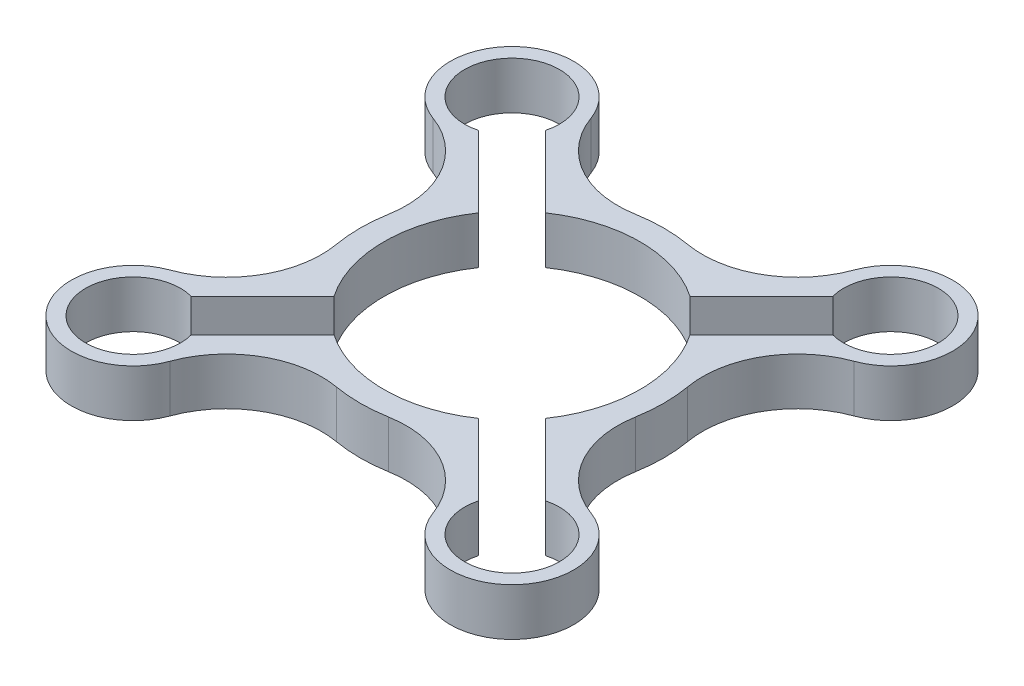
ISO-10303-21;
HEADER;
FILE_DESCRIPTION(('STEP AP214'),'2;1');
FILE_NAME('part.step','',(''),(''),'','','');
FILE_SCHEMA(('AUTOMOTIVE_DESIGN { 1 0 10303 214 1 1 1 1 }'));
ENDSEC;
DATA;
#1=APPLICATION_CONTEXT('core data for automotive mechanical design processes');
#2=APPLICATION_PROTOCOL_DEFINITION('international standard','automotive_design',2000,#1);
#3=PRODUCT_CONTEXT('',#1,'mechanical');
#4=PRODUCT('Part','Part','',(#3));
#5=PRODUCT_RELATED_PRODUCT_CATEGORY('part','',(#4));
#6=PRODUCT_DEFINITION_FORMATION('','',#4);
#7=PRODUCT_DEFINITION_CONTEXT('part definition',#1,'design');
#8=PRODUCT_DEFINITION('design','',#6,#7);
#9=PRODUCT_DEFINITION_SHAPE('','',#8);
#10=(LENGTH_UNIT() NAMED_UNIT(*) SI_UNIT(.MILLI.,.METRE.));
#11=(NAMED_UNIT(*) PLANE_ANGLE_UNIT() SI_UNIT($,.RADIAN.));
#12=(NAMED_UNIT(*) SI_UNIT($,.STERADIAN.) SOLID_ANGLE_UNIT());
#13=UNCERTAINTY_MEASURE_WITH_UNIT(LENGTH_MEASURE(1.E-05),#10,'distance_accuracy_value','');
#14=(GEOMETRIC_REPRESENTATION_CONTEXT(3) GLOBAL_UNCERTAINTY_ASSIGNED_CONTEXT((#13)) GLOBAL_UNIT_ASSIGNED_CONTEXT((#10,
#11,#12)) REPRESENTATION_CONTEXT('',''));
#15=CARTESIAN_POINT('',(0.,0.,0.));
#16=DIRECTION('',(0.,0.,1.));
#17=DIRECTION('',(1.,0.,0.));
#18=AXIS2_PLACEMENT_3D('',#15,#16,#17);
#19=CARTESIAN_POINT('',(-4.46865767521835,10.,-25.6131040403484));
#20=DIRECTION('',(0.,1.,0.));
#21=DIRECTION('',(0.,0.,1.));
#22=AXIS2_PLACEMENT_3D('',#19,#20,#21);
#23=PLANE('',#22);
#24=CARTESIAN_POINT('',(-8.93731535043669,10.,-51.2262080806968));
#25=DIRECTION('',(0.,-1.,0.));
#26=DIRECTION('',(0.,0.,1.));
#27=AXIS2_PLACEMENT_3D('',#24,#25,#26);
#28=CIRCLE('',#27,20.);
#29=CARTESIAN_POINT('',(-5.4998863694995,10.,-31.5238203573519));
#30=VERTEX_POINT('',#29);
#31=CARTESIAN_POINT('',(-27.7338109786812,10.,-44.3930717512077));
#32=VERTEX_POINT('',#31);
#33=EDGE_CURVE('E367',#30,#32,#28,.T.);
#34=ORIENTED_EDGE('',*,*,#33,.T.);
#35=CARTESIAN_POINT('',(-39.9515331370402,10.,-39.9515331370397));
#36=DIRECTION('',(0.,1.,0.));
#37=DIRECTION('',(0.,0.,1.));
#38=AXIS2_PLACEMENT_3D('',#35,#36,#37);
#39=CIRCLE('',#38,13.);
#40=CARTESIAN_POINT('',(-44.393071751208,10.,-27.7338109786807));
#41=VERTEX_POINT('',#40);
#42=EDGE_CURVE('E370',#32,#41,#39,.T.);
#43=ORIENTED_EDGE('',*,*,#42,.T.);
#44=CARTESIAN_POINT('',(-51.2262080806969,10.,-8.93731535043613));
#45=DIRECTION('',(0.,-1.,0.));
#46=DIRECTION('',(0.,0.,-1.));
#47=AXIS2_PLACEMENT_3D('',#44,#45,#46);
#48=CIRCLE('',#47,20.);
#49=CARTESIAN_POINT('',(-31.523820357352,10.,-5.49988636949915));
#50=VERTEX_POINT('',#49);
#51=EDGE_CURVE('E373',#41,#50,#48,.T.);
#52=ORIENTED_EDGE('',*,*,#51,.T.);
#53=CARTESIAN_POINT('',(0.,10.,0.));
#54=DIRECTION('',(0.,1.,0.));
#55=DIRECTION('',(0.,0.,1.));
#56=AXIS2_PLACEMENT_3D('',#53,#54,#55);
#57=CIRCLE('',#56,32.);
#58=CARTESIAN_POINT('',(-31.523820357352,10.,5.49988636949914));
#59=VERTEX_POINT('',#58);
#60=EDGE_CURVE('E375',#50,#59,#57,.T.);
#61=ORIENTED_EDGE('',*,*,#60,.T.);
#62=CARTESIAN_POINT('',(-51.2262080806969,10.,8.93731535043614));
#63=DIRECTION('',(0.,-1.,0.));
#64=DIRECTION('',(0.,0.,1.));
#65=AXIS2_PLACEMENT_3D('',#62,#63,#64);
#66=CIRCLE('',#65,20.);
#67=CARTESIAN_POINT('',(-44.393071751208,10.,27.7338109786807));
#68=VERTEX_POINT('',#67);
#69=EDGE_CURVE('E377',#59,#68,#66,.T.);
#70=ORIENTED_EDGE('',*,*,#69,.T.);
#71=CARTESIAN_POINT('',(-39.9515331370401,10.,39.9515331370397));
#72=DIRECTION('',(0.,1.,0.));
#73=DIRECTION('',(0.,0.,-1.));
#74=AXIS2_PLACEMENT_3D('',#71,#72,#73);
#75=CIRCLE('',#74,13.);
#76=CARTESIAN_POINT('',(-27.7338109786812,10.,44.3930717512077));
#77=VERTEX_POINT('',#76);
#78=EDGE_CURVE('E379',#68,#77,#75,.T.);
#79=ORIENTED_EDGE('',*,*,#78,.T.);
#80=CARTESIAN_POINT('',(-8.93731535043668,10.,51.2262080806968));
#81=DIRECTION('',(0.,-1.,0.));
#82=DIRECTION('',(0.,0.,-1.));
#83=AXIS2_PLACEMENT_3D('',#80,#81,#82);
#84=CIRCLE('',#83,20.);
#85=CARTESIAN_POINT('',(-5.4998863694995,10.,31.5238203573519));
#86=VERTEX_POINT('',#85);
#87=EDGE_CURVE('E381',#77,#86,#84,.T.);
#88=ORIENTED_EDGE('',*,*,#87,.T.);
#89=CARTESIAN_POINT('',(0.,10.,0.));
#90=DIRECTION('',(0.,1.,0.));
#91=DIRECTION('',(0.,0.,1.));
#92=AXIS2_PLACEMENT_3D('',#89,#90,#91);
#93=CIRCLE('',#92,32.);
#94=CARTESIAN_POINT('',(5.49988636949951,10.,31.5238203573519));
#95=VERTEX_POINT('',#94);
#96=EDGE_CURVE('E383',#86,#95,#93,.T.);
#97=ORIENTED_EDGE('',*,*,#96,.T.);
#98=CARTESIAN_POINT('',(8.93731535043671,10.,51.2262080806968));
#99=DIRECTION('',(0.,-1.,0.));
#100=DIRECTION('',(0.,0.,1.));
#101=AXIS2_PLACEMENT_3D('',#98,#99,#100);
#102=CIRCLE('',#101,20.);
#103=CARTESIAN_POINT('',(27.7338109786812,10.,44.3930717512077));
#104=VERTEX_POINT('',#103);
#105=EDGE_CURVE('E385',#95,#104,#102,.T.);
#106=ORIENTED_EDGE('',*,*,#105,.T.);
#107=CARTESIAN_POINT('',(39.9515331370402,10.,39.9515331370397));
#108=DIRECTION('',(0.,1.,0.));
#109=DIRECTION('',(0.,0.,1.));
#110=AXIS2_PLACEMENT_3D('',#107,#108,#109);
#111=CIRCLE('',#110,13.);
#112=CARTESIAN_POINT('',(44.393071751208,10.,27.7338109786807));
#113=VERTEX_POINT('',#112);
#114=EDGE_CURVE('E387',#104,#113,#111,.T.);
#115=ORIENTED_EDGE('',*,*,#114,.T.);
#116=CARTESIAN_POINT('',(51.2262080806969,10.,8.93731535043611));
#117=DIRECTION('',(0.,-1.,0.));
#118=DIRECTION('',(0.,0.,-1.));
#119=AXIS2_PLACEMENT_3D('',#116,#117,#118);
#120=CIRCLE('',#119,20.);
#121=CARTESIAN_POINT('',(31.523820357352,10.,5.49988636949915));
#122=VERTEX_POINT('',#121);
#123=EDGE_CURVE('E389',#113,#122,#120,.T.);
#124=ORIENTED_EDGE('',*,*,#123,.T.);
#125=CARTESIAN_POINT('',(0.,10.,0.));
#126=DIRECTION('',(0.,1.,0.));
#127=DIRECTION('',(0.,0.,1.));
#128=AXIS2_PLACEMENT_3D('',#125,#126,#127);
#129=CIRCLE('',#128,32.);
#130=CARTESIAN_POINT('',(31.523820357352,10.,-5.49988636949915));
#131=VERTEX_POINT('',#130);
#132=EDGE_CURVE('E391',#122,#131,#129,.T.);
#133=ORIENTED_EDGE('',*,*,#132,.T.);
#134=CARTESIAN_POINT('',(51.2262080806969,10.,-8.93731535043613));
#135=DIRECTION('',(0.,-1.,0.));
#136=DIRECTION('',(0.,0.,1.));
#137=AXIS2_PLACEMENT_3D('',#134,#135,#136);
#138=CIRCLE('',#137,20.);
#139=CARTESIAN_POINT('',(44.393071751208,10.,-27.7338109786807));
#140=VERTEX_POINT('',#139);
#141=EDGE_CURVE('E393',#131,#140,#138,.T.);
#142=ORIENTED_EDGE('',*,*,#141,.T.);
#143=CARTESIAN_POINT('',(39.9515331370402,10.,-39.9515331370397));
#144=DIRECTION('',(0.,1.,0.));
#145=DIRECTION('',(0.,0.,-1.));
#146=AXIS2_PLACEMENT_3D('',#143,#144,#145);
#147=CIRCLE('',#146,13.);
#148=CARTESIAN_POINT('',(27.7338109786812,10.,-44.3930717512077));
#149=VERTEX_POINT('',#148);
#150=EDGE_CURVE('E395',#140,#149,#147,.T.);
#151=ORIENTED_EDGE('',*,*,#150,.T.);
#152=CARTESIAN_POINT('',(8.93731535043669,10.,-51.2262080806968));
#153=DIRECTION('',(0.,-1.,0.));
#154=DIRECTION('',(0.,0.,-1.));
#155=AXIS2_PLACEMENT_3D('',#152,#153,#154);
#156=CIRCLE('',#155,20.);
#157=CARTESIAN_POINT('',(5.49988636949951,10.,-31.5238203573519));
#158=VERTEX_POINT('',#157);
#159=EDGE_CURVE('E397',#149,#158,#156,.T.);
#160=ORIENTED_EDGE('',*,*,#159,.T.);
#161=CARTESIAN_POINT('',(0.,10.,0.));
#162=DIRECTION('',(0.,1.,0.));
#163=DIRECTION('',(0.,0.,1.));
#164=AXIS2_PLACEMENT_3D('',#161,#162,#163);
#165=CIRCLE('',#164,32.);
#166=EDGE_CURVE('E399',#158,#30,#165,.T.);
#167=ORIENTED_EDGE('',*,*,#166,.T.);
#168=EDGE_LOOP('',(#34,#43,#52,#61,#70,#79,#88,#97,#106,#115,#124,#133,#142,#151,#160,#167));
#169=FACE_BOUND('',#168,.T.);
#170=DIRECTION('',(0.707106781186552,0.,0.707106781186543));
#171=VECTOR('',#170,1.);
#172=CARTESIAN_POINT('',(-37.3633426860149,10.,-30.2922748741491));
#173=LINE('',#172,#171);
#174=CARTESIAN_POINT('',(-37.3633426860149,10.,-30.2922748741491));
#175=VERTEX_POINT('',#174);
#176=CARTESIAN_POINT('',(-22.2971969452265,10.,-15.2261291333609));
#177=VERTEX_POINT('',#176);
#178=EDGE_CURVE('E254',#175,#177,#173,.T.);
#179=ORIENTED_EDGE('',*,*,#178,.F.);
#180=CARTESIAN_POINT('',(-39.9515331370402,10.,-39.9515331370397));
#181=DIRECTION('',(0.,1.,0.));
#182=DIRECTION('',(0.,0.,1.));
#183=AXIS2_PLACEMENT_3D('',#180,#181,#182);
#184=CIRCLE('',#183,10.);
#185=CARTESIAN_POINT('',(-30.2922748741495,10.,-37.3633426860146));
#186=VERTEX_POINT('',#185);
#187=EDGE_CURVE('E246',#186,#175,#184,.T.);
#188=ORIENTED_EDGE('',*,*,#187,.F.);
#189=DIRECTION('',(-0.707106781186551,0.,-0.707106781186544));
#190=VECTOR('',#189,1.);
#191=CARTESIAN_POINT('',(-30.2922748741495,10.,-37.3633426860146));
#192=LINE('',#191,#190);
#193=CARTESIAN_POINT('',(-15.2261291333611,10.,-22.2971969452264));
#194=VERTEX_POINT('',#193);
#195=EDGE_CURVE('E295',#194,#186,#192,.T.);
#196=ORIENTED_EDGE('',*,*,#195,.F.);
#197=CARTESIAN_POINT('',(0.,10.,0.));
#198=DIRECTION('',(0.,1.,0.));
#199=DIRECTION('',(0.,0.,1.));
#200=AXIS2_PLACEMENT_3D('',#197,#198,#199);
#201=CIRCLE('',#200,27.);
#202=CARTESIAN_POINT('',(15.2261291333611,10.,-22.2971969452264));
#203=VERTEX_POINT('',#202);
#204=EDGE_CURVE('E293',#203,#194,#201,.T.);
#205=ORIENTED_EDGE('',*,*,#204,.F.);
#206=DIRECTION('',(-0.707106781186551,0.,0.707106781186544));
#207=VECTOR('',#206,1.);
#208=CARTESIAN_POINT('',(30.2922748741495,10.,-37.3633426860146));
#209=LINE('',#208,#207);
#210=CARTESIAN_POINT('',(30.2922748741495,10.,-37.3633426860146));
#211=VERTEX_POINT('',#210);
#212=EDGE_CURVE('E291',#211,#203,#209,.T.);
#213=ORIENTED_EDGE('',*,*,#212,.F.);
#214=CARTESIAN_POINT('',(39.9515331370402,10.,-39.9515331370397));
#215=DIRECTION('',(0.,1.,0.));
#216=DIRECTION('',(0.,0.,-1.));
#217=AXIS2_PLACEMENT_3D('',#214,#215,#216);
#218=CIRCLE('',#217,10.);
#219=CARTESIAN_POINT('',(37.3633426860149,10.,-30.292274874149));
#220=VERTEX_POINT('',#219);
#221=EDGE_CURVE('E289',#220,#211,#218,.T.);
#222=ORIENTED_EDGE('',*,*,#221,.F.);
#223=DIRECTION('',(0.707106781186551,0.,-0.707106781186544));
#224=VECTOR('',#223,1.);
#225=CARTESIAN_POINT('',(37.3633426860149,10.,-30.292274874149));
#226=LINE('',#225,#224);
#227=CARTESIAN_POINT('',(22.2971969452265,10.,-15.2261291333608));
#228=VERTEX_POINT('',#227);
#229=EDGE_CURVE('E287',#228,#220,#226,.T.);
#230=ORIENTED_EDGE('',*,*,#229,.F.);
#231=CARTESIAN_POINT('',(0.,10.,0.));
#232=DIRECTION('',(0.,1.,0.));
#233=DIRECTION('',(0.,0.,1.));
#234=AXIS2_PLACEMENT_3D('',#231,#232,#233);
#235=CIRCLE('',#234,27.);
#236=CARTESIAN_POINT('',(22.2971969452266,10.,15.2261291333608));
#237=VERTEX_POINT('',#236);
#238=EDGE_CURVE('E285',#237,#228,#235,.T.);
#239=ORIENTED_EDGE('',*,*,#238,.F.);
#240=DIRECTION('',(-0.707106781186551,0.,-0.707106781186544));
#241=VECTOR('',#240,1.);
#242=CARTESIAN_POINT('',(37.3633426860149,10.,30.292274874149));
#243=LINE('',#242,#241);
#244=CARTESIAN_POINT('',(37.3633426860149,10.,30.292274874149));
#245=VERTEX_POINT('',#244);
#246=EDGE_CURVE('E283',#245,#237,#243,.T.);
#247=ORIENTED_EDGE('',*,*,#246,.F.);
#248=CARTESIAN_POINT('',(39.9515331370402,10.,39.9515331370397));
#249=DIRECTION('',(0.,1.,0.));
#250=DIRECTION('',(0.,0.,1.));
#251=AXIS2_PLACEMENT_3D('',#248,#249,#250);
#252=CIRCLE('',#251,10.);
#253=CARTESIAN_POINT('',(30.2922748741495,10.,37.3633426860145));
#254=VERTEX_POINT('',#253);
#255=EDGE_CURVE('E281',#254,#245,#252,.T.);
#256=ORIENTED_EDGE('',*,*,#255,.F.);
#257=DIRECTION('',(0.707106781186551,0.,0.707106781186543));
#258=VECTOR('',#257,1.);
#259=CARTESIAN_POINT('',(30.2922748741495,10.,37.3633426860145));
#260=LINE('',#259,#258);
#261=CARTESIAN_POINT('',(15.2261291333611,10.,22.2971969452264));
#262=VERTEX_POINT('',#261);
#263=EDGE_CURVE('E279',#262,#254,#260,.T.);
#264=ORIENTED_EDGE('',*,*,#263,.F.);
#265=CARTESIAN_POINT('',(0.,10.,0.));
#266=DIRECTION('',(0.,1.,0.));
#267=DIRECTION('',(0.,0.,1.));
#268=AXIS2_PLACEMENT_3D('',#265,#266,#267);
#269=CIRCLE('',#268,27.);
#270=CARTESIAN_POINT('',(-15.2261291333611,10.,22.2971969452264));
#271=VERTEX_POINT('',#270);
#272=EDGE_CURVE('E277',#271,#262,#269,.T.);
#273=ORIENTED_EDGE('',*,*,#272,.F.);
#274=DIRECTION('',(0.707106781186551,0.,-0.707106781186544));
#275=VECTOR('',#274,1.);
#276=CARTESIAN_POINT('',(-30.2922748741495,10.,37.3633426860146));
#277=LINE('',#276,#275);
#278=CARTESIAN_POINT('',(-30.2922748741494,10.,37.3633426860146));
#279=VERTEX_POINT('',#278);
#280=EDGE_CURVE('E275',#279,#271,#277,.T.);
#281=ORIENTED_EDGE('',*,*,#280,.F.);
#282=CARTESIAN_POINT('',(-39.9515331370401,10.,39.9515331370397));
#283=DIRECTION('',(0.,1.,0.));
#284=DIRECTION('',(0.,0.,-1.));
#285=AXIS2_PLACEMENT_3D('',#282,#283,#284);
#286=CIRCLE('',#285,10.);
#287=CARTESIAN_POINT('',(-37.3633426860149,10.,30.2922748741491));
#288=VERTEX_POINT('',#287);
#289=EDGE_CURVE('E273',#288,#279,#286,.T.);
#290=ORIENTED_EDGE('',*,*,#289,.F.);
#291=DIRECTION('',(-0.707106781186552,0.,0.707106781186544));
#292=VECTOR('',#291,1.);
#293=CARTESIAN_POINT('',(-37.3633426860149,10.,30.2922748741491));
#294=LINE('',#293,#292);
#295=CARTESIAN_POINT('',(-22.2971969452265,10.,15.2261291333609));
#296=VERTEX_POINT('',#295);
#297=EDGE_CURVE('E269',#296,#288,#294,.T.);
#298=ORIENTED_EDGE('',*,*,#297,.F.);
#299=CARTESIAN_POINT('',(0.,10.,0.));
#300=DIRECTION('',(0.,1.,0.));
#301=DIRECTION('',(0.,0.,1.));
#302=AXIS2_PLACEMENT_3D('',#299,#300,#301);
#303=CIRCLE('',#302,27.);
#304=EDGE_CURVE('E267',#177,#296,#303,.T.);
#305=ORIENTED_EDGE('',*,*,#304,.F.);
#306=EDGE_LOOP('',(#179,#188,#196,#205,#213,#222,#230,#239,#247,#256,#264,#273,#281,#290,#298,#305));
#307=FACE_BOUND('',#306,.T.);
#308=ADVANCED_FACE('F37',(#169,#307),#23,.T.);
#309=CARTESIAN_POINT('',(-4.46865767521835,0.,-25.6131040403484));
#310=DIRECTION('',(0.,1.,0.));
#311=DIRECTION('',(0.,0.,1.));
#312=AXIS2_PLACEMENT_3D('',#309,#310,#311);
#313=PLANE('',#312);
#314=CARTESIAN_POINT('',(-8.93731535043669,0.,-51.2262080806968));
#315=DIRECTION('',(0.,-1.,0.));
#316=DIRECTION('',(0.,0.,1.));
#317=AXIS2_PLACEMENT_3D('',#314,#315,#316);
#318=CIRCLE('',#317,20.);
#319=CARTESIAN_POINT('',(-5.4998863694995,0.,-31.5238203573519));
#320=VERTEX_POINT('',#319);
#321=CARTESIAN_POINT('',(-27.7338109786812,0.,-44.3930717512077));
#322=VERTEX_POINT('',#321);
#323=EDGE_CURVE('E262',#320,#322,#318,.T.);
#324=ORIENTED_EDGE('',*,*,#323,.F.);
#325=CARTESIAN_POINT('',(0.,0.,0.));
#326=DIRECTION('',(0.,1.,0.));
#327=DIRECTION('',(0.,0.,1.));
#328=AXIS2_PLACEMENT_3D('',#325,#326,#327);
#329=CIRCLE('',#328,32.);
#330=CARTESIAN_POINT('',(5.49988636949951,0.,-31.5238203573519));
#331=VERTEX_POINT('',#330);
#332=EDGE_CURVE('E371',#331,#320,#329,.T.);
#333=ORIENTED_EDGE('',*,*,#332,.F.);
#334=CARTESIAN_POINT('',(8.93731535043669,0.,-51.2262080806968));
#335=DIRECTION('',(0.,-1.,0.));
#336=DIRECTION('',(0.,0.,-1.));
#337=AXIS2_PLACEMENT_3D('',#334,#335,#336);
#338=CIRCLE('',#337,20.);
#339=CARTESIAN_POINT('',(27.7338109786812,0.,-44.3930717512077));
#340=VERTEX_POINT('',#339);
#341=EDGE_CURVE('E430',#340,#331,#338,.T.);
#342=ORIENTED_EDGE('',*,*,#341,.F.);
#343=CARTESIAN_POINT('',(39.9515331370402,0.,-39.9515331370397));
#344=DIRECTION('',(0.,1.,0.));
#345=DIRECTION('',(0.,0.,-1.));
#346=AXIS2_PLACEMENT_3D('',#343,#344,#345);
#347=CIRCLE('',#346,13.);
#348=CARTESIAN_POINT('',(44.393071751208,0.,-27.7338109786807));
#349=VERTEX_POINT('',#348);
#350=EDGE_CURVE('E428',#349,#340,#347,.T.);
#351=ORIENTED_EDGE('',*,*,#350,.F.);
#352=CARTESIAN_POINT('',(51.2262080806969,0.,-8.93731535043613));
#353=DIRECTION('',(0.,-1.,0.));
#354=DIRECTION('',(0.,0.,1.));
#355=AXIS2_PLACEMENT_3D('',#352,#353,#354);
#356=CIRCLE('',#355,20.);
#357=CARTESIAN_POINT('',(31.523820357352,0.,-5.49988636949915));
#358=VERTEX_POINT('',#357);
#359=EDGE_CURVE('E426',#358,#349,#356,.T.);
#360=ORIENTED_EDGE('',*,*,#359,.F.);
#361=CARTESIAN_POINT('',(0.,0.,0.));
#362=DIRECTION('',(0.,1.,0.));
#363=DIRECTION('',(0.,0.,1.));
#364=AXIS2_PLACEMENT_3D('',#361,#362,#363);
#365=CIRCLE('',#364,32.);
#366=CARTESIAN_POINT('',(31.523820357352,0.,5.49988636949915));
#367=VERTEX_POINT('',#366);
#368=EDGE_CURVE('E424',#367,#358,#365,.T.);
#369=ORIENTED_EDGE('',*,*,#368,.F.);
#370=CARTESIAN_POINT('',(51.2262080806969,0.,8.93731535043611));
#371=DIRECTION('',(0.,-1.,0.));
#372=DIRECTION('',(0.,0.,-1.));
#373=AXIS2_PLACEMENT_3D('',#370,#371,#372);
#374=CIRCLE('',#373,20.);
#375=CARTESIAN_POINT('',(44.393071751208,0.,27.7338109786807));
#376=VERTEX_POINT('',#375);
#377=EDGE_CURVE('E422',#376,#367,#374,.T.);
#378=ORIENTED_EDGE('',*,*,#377,.F.);
#379=CARTESIAN_POINT('',(39.9515331370402,0.,39.9515331370397));
#380=DIRECTION('',(0.,1.,0.));
#381=DIRECTION('',(0.,0.,1.));
#382=AXIS2_PLACEMENT_3D('',#379,#380,#381);
#383=CIRCLE('',#382,13.);
#384=CARTESIAN_POINT('',(27.7338109786812,0.,44.3930717512077));
#385=VERTEX_POINT('',#384);
#386=EDGE_CURVE('E420',#385,#376,#383,.T.);
#387=ORIENTED_EDGE('',*,*,#386,.F.);
#388=CARTESIAN_POINT('',(8.93731535043671,0.,51.2262080806968));
#389=DIRECTION('',(0.,-1.,0.));
#390=DIRECTION('',(0.,0.,1.));
#391=AXIS2_PLACEMENT_3D('',#388,#389,#390);
#392=CIRCLE('',#391,20.);
#393=CARTESIAN_POINT('',(5.49988636949951,0.,31.5238203573519));
#394=VERTEX_POINT('',#393);
#395=EDGE_CURVE('E418',#394,#385,#392,.T.);
#396=ORIENTED_EDGE('',*,*,#395,.F.);
#397=CARTESIAN_POINT('',(0.,0.,0.));
#398=DIRECTION('',(0.,1.,0.));
#399=DIRECTION('',(0.,0.,1.));
#400=AXIS2_PLACEMENT_3D('',#397,#398,#399);
#401=CIRCLE('',#400,32.);
#402=CARTESIAN_POINT('',(-5.4998863694995,0.,31.5238203573519));
#403=VERTEX_POINT('',#402);
#404=EDGE_CURVE('E416',#403,#394,#401,.T.);
#405=ORIENTED_EDGE('',*,*,#404,.F.);
#406=CARTESIAN_POINT('',(-8.93731535043668,0.,51.2262080806968));
#407=DIRECTION('',(0.,-1.,0.));
#408=DIRECTION('',(0.,0.,-1.));
#409=AXIS2_PLACEMENT_3D('',#406,#407,#408);
#410=CIRCLE('',#409,20.);
#411=CARTESIAN_POINT('',(-27.7338109786812,0.,44.3930717512077));
#412=VERTEX_POINT('',#411);
#413=EDGE_CURVE('E414',#412,#403,#410,.T.);
#414=ORIENTED_EDGE('',*,*,#413,.F.);
#415=CARTESIAN_POINT('',(-39.9515331370401,0.,39.9515331370397));
#416=DIRECTION('',(0.,1.,0.));
#417=DIRECTION('',(0.,0.,-1.));
#418=AXIS2_PLACEMENT_3D('',#415,#416,#417);
#419=CIRCLE('',#418,13.);
#420=CARTESIAN_POINT('',(-44.393071751208,0.,27.7338109786807));
#421=VERTEX_POINT('',#420);
#422=EDGE_CURVE('E412',#421,#412,#419,.T.);
#423=ORIENTED_EDGE('',*,*,#422,.F.);
#424=CARTESIAN_POINT('',(-51.2262080806969,0.,8.93731535043614));
#425=DIRECTION('',(0.,-1.,0.));
#426=DIRECTION('',(0.,0.,1.));
#427=AXIS2_PLACEMENT_3D('',#424,#425,#426);
#428=CIRCLE('',#427,20.);
#429=CARTESIAN_POINT('',(-31.523820357352,0.,5.49988636949914));
#430=VERTEX_POINT('',#429);
#431=EDGE_CURVE('E410',#430,#421,#428,.T.);
#432=ORIENTED_EDGE('',*,*,#431,.F.);
#433=CARTESIAN_POINT('',(0.,0.,0.));
#434=DIRECTION('',(0.,1.,0.));
#435=DIRECTION('',(0.,0.,1.));
#436=AXIS2_PLACEMENT_3D('',#433,#434,#435);
#437=CIRCLE('',#436,32.);
#438=CARTESIAN_POINT('',(-31.523820357352,0.,-5.49988636949915));
#439=VERTEX_POINT('',#438);
#440=EDGE_CURVE('E408',#439,#430,#437,.T.);
#441=ORIENTED_EDGE('',*,*,#440,.F.);
#442=CARTESIAN_POINT('',(-51.2262080806969,0.,-8.93731535043613));
#443=DIRECTION('',(0.,-1.,0.));
#444=DIRECTION('',(0.,0.,-1.));
#445=AXIS2_PLACEMENT_3D('',#442,#443,#444);
#446=CIRCLE('',#445,20.);
#447=CARTESIAN_POINT('',(-44.393071751208,0.,-27.7338109786807));
#448=VERTEX_POINT('',#447);
#449=EDGE_CURVE('E406',#448,#439,#446,.T.);
#450=ORIENTED_EDGE('',*,*,#449,.F.);
#451=CARTESIAN_POINT('',(-39.9515331370402,0.,-39.9515331370397));
#452=DIRECTION('',(0.,1.,0.));
#453=DIRECTION('',(0.,0.,1.));
#454=AXIS2_PLACEMENT_3D('',#451,#452,#453);
#455=CIRCLE('',#454,13.);
#456=EDGE_CURVE('E404',#322,#448,#455,.T.);
#457=ORIENTED_EDGE('',*,*,#456,.F.);
#458=EDGE_LOOP('',(#324,#333,#342,#351,#360,#369,#378,#387,#396,#405,#414,#423,#432,#441,#450,#457));
#459=FACE_BOUND('',#458,.T.);
#460=CARTESIAN_POINT('',(-39.9515331370402,0.,-39.9515331370397));
#461=DIRECTION('',(0.,1.,0.));
#462=DIRECTION('',(0.,0.,1.));
#463=AXIS2_PLACEMENT_3D('',#460,#461,#462);
#464=CIRCLE('',#463,10.);
#465=CARTESIAN_POINT('',(-30.2922748741495,0.,-37.3633426860146));
#466=VERTEX_POINT('',#465);
#467=CARTESIAN_POINT('',(-37.3633426860149,0.,-30.2922748741491));
#468=VERTEX_POINT('',#467);
#469=EDGE_CURVE('E60',#466,#468,#464,.T.);
#470=ORIENTED_EDGE('',*,*,#469,.T.);
#471=DIRECTION('',(0.707106781186552,0.,0.707106781186543));
#472=VECTOR('',#471,1.);
#473=CARTESIAN_POINT('',(-37.3633426860149,0.,-30.2922748741491));
#474=LINE('',#473,#472);
#475=CARTESIAN_POINT('',(-22.2971969452265,0.,-15.2261291333609));
#476=VERTEX_POINT('',#475);
#477=EDGE_CURVE('E261',#468,#476,#474,.T.);
#478=ORIENTED_EDGE('',*,*,#477,.T.);
#479=CARTESIAN_POINT('',(0.,0.,0.));
#480=DIRECTION('',(0.,1.,0.));
#481=DIRECTION('',(0.,0.,1.));
#482=AXIS2_PLACEMENT_3D('',#479,#480,#481);
#483=CIRCLE('',#482,27.);
#484=CARTESIAN_POINT('',(-22.2971969452265,0.,15.2261291333609));
#485=VERTEX_POINT('',#484);
#486=EDGE_CURVE('E299',#476,#485,#483,.T.);
#487=ORIENTED_EDGE('',*,*,#486,.T.);
#488=DIRECTION('',(-0.707106781186552,0.,0.707106781186544));
#489=VECTOR('',#488,1.);
#490=CARTESIAN_POINT('',(-37.3633426860149,0.,30.2922748741491));
#491=LINE('',#490,#489);
#492=CARTESIAN_POINT('',(-37.3633426860149,0.,30.2922748741491));
#493=VERTEX_POINT('',#492);
#494=EDGE_CURVE('E302',#485,#493,#491,.T.);
#495=ORIENTED_EDGE('',*,*,#494,.T.);
#496=CARTESIAN_POINT('',(-39.9515331370401,0.,39.9515331370397));
#497=DIRECTION('',(0.,1.,0.));
#498=DIRECTION('',(0.,0.,-1.));
#499=AXIS2_PLACEMENT_3D('',#496,#497,#498);
#500=CIRCLE('',#499,10.);
#501=CARTESIAN_POINT('',(-30.2922748741494,0.,37.3633426860146));
#502=VERTEX_POINT('',#501);
#503=EDGE_CURVE('E305',#493,#502,#500,.T.);
#504=ORIENTED_EDGE('',*,*,#503,.T.);
#505=DIRECTION('',(0.707106781186551,0.,-0.707106781186544));
#506=VECTOR('',#505,1.);
#507=CARTESIAN_POINT('',(-30.2922748741495,0.,37.3633426860146));
#508=LINE('',#507,#506);
#509=CARTESIAN_POINT('',(-15.2261291333611,0.,22.2971969452264));
#510=VERTEX_POINT('',#509);
#511=EDGE_CURVE('E308',#502,#510,#508,.T.);
#512=ORIENTED_EDGE('',*,*,#511,.T.);
#513=CARTESIAN_POINT('',(0.,0.,0.));
#514=DIRECTION('',(0.,1.,0.));
#515=DIRECTION('',(0.,0.,1.));
#516=AXIS2_PLACEMENT_3D('',#513,#514,#515);
#517=CIRCLE('',#516,27.);
#518=CARTESIAN_POINT('',(15.2261291333611,0.,22.2971969452264));
#519=VERTEX_POINT('',#518);
#520=EDGE_CURVE('E311',#510,#519,#517,.T.);
#521=ORIENTED_EDGE('',*,*,#520,.T.);
#522=DIRECTION('',(0.707106781186551,0.,0.707106781186543));
#523=VECTOR('',#522,1.);
#524=CARTESIAN_POINT('',(30.2922748741495,0.,37.3633426860145));
#525=LINE('',#524,#523);
#526=CARTESIAN_POINT('',(30.2922748741495,0.,37.3633426860145));
#527=VERTEX_POINT('',#526);
#528=EDGE_CURVE('E314',#519,#527,#525,.T.);
#529=ORIENTED_EDGE('',*,*,#528,.T.);
#530=CARTESIAN_POINT('',(39.9515331370402,0.,39.9515331370397));
#531=DIRECTION('',(0.,1.,0.));
#532=DIRECTION('',(0.,0.,1.));
#533=AXIS2_PLACEMENT_3D('',#530,#531,#532);
#534=CIRCLE('',#533,10.);
#535=CARTESIAN_POINT('',(37.3633426860149,0.,30.292274874149));
#536=VERTEX_POINT('',#535);
#537=EDGE_CURVE('E317',#527,#536,#534,.T.);
#538=ORIENTED_EDGE('',*,*,#537,.T.);
#539=DIRECTION('',(-0.707106781186551,0.,-0.707106781186544));
#540=VECTOR('',#539,1.);
#541=CARTESIAN_POINT('',(37.3633426860149,0.,30.292274874149));
#542=LINE('',#541,#540);
#543=CARTESIAN_POINT('',(22.2971969452266,0.,15.2261291333608));
#544=VERTEX_POINT('',#543);
#545=EDGE_CURVE('E320',#536,#544,#542,.T.);
#546=ORIENTED_EDGE('',*,*,#545,.T.);
#547=CARTESIAN_POINT('',(0.,0.,0.));
#548=DIRECTION('',(0.,1.,0.));
#549=DIRECTION('',(0.,0.,1.));
#550=AXIS2_PLACEMENT_3D('',#547,#548,#549);
#551=CIRCLE('',#550,27.);
#552=CARTESIAN_POINT('',(22.2971969452265,0.,-15.2261291333608));
#553=VERTEX_POINT('',#552);
#554=EDGE_CURVE('E323',#544,#553,#551,.T.);
#555=ORIENTED_EDGE('',*,*,#554,.T.);
#556=DIRECTION('',(0.707106781186551,0.,-0.707106781186544));
#557=VECTOR('',#556,1.);
#558=CARTESIAN_POINT('',(37.3633426860149,0.,-30.292274874149));
#559=LINE('',#558,#557);
#560=CARTESIAN_POINT('',(37.3633426860149,0.,-30.292274874149));
#561=VERTEX_POINT('',#560);
#562=EDGE_CURVE('E326',#553,#561,#559,.T.);
#563=ORIENTED_EDGE('',*,*,#562,.T.);
#564=CARTESIAN_POINT('',(39.9515331370402,0.,-39.9515331370397));
#565=DIRECTION('',(0.,1.,0.));
#566=DIRECTION('',(0.,0.,-1.));
#567=AXIS2_PLACEMENT_3D('',#564,#565,#566);
#568=CIRCLE('',#567,10.);
#569=CARTESIAN_POINT('',(30.2922748741495,0.,-37.3633426860146));
#570=VERTEX_POINT('',#569);
#571=EDGE_CURVE('E329',#561,#570,#568,.T.);
#572=ORIENTED_EDGE('',*,*,#571,.T.);
#573=DIRECTION('',(-0.707106781186551,0.,0.707106781186544));
#574=VECTOR('',#573,1.);
#575=CARTESIAN_POINT('',(30.2922748741495,0.,-37.3633426860146));
#576=LINE('',#575,#574);
#577=CARTESIAN_POINT('',(15.2261291333611,0.,-22.2971969452264));
#578=VERTEX_POINT('',#577);
#579=EDGE_CURVE('E332',#570,#578,#576,.T.);
#580=ORIENTED_EDGE('',*,*,#579,.T.);
#581=CARTESIAN_POINT('',(0.,0.,0.));
#582=DIRECTION('',(0.,1.,0.));
#583=DIRECTION('',(0.,0.,1.));
#584=AXIS2_PLACEMENT_3D('',#581,#582,#583);
#585=CIRCLE('',#584,27.);
#586=CARTESIAN_POINT('',(-15.2261291333611,0.,-22.2971969452264));
#587=VERTEX_POINT('',#586);
#588=EDGE_CURVE('E335',#578,#587,#585,.T.);
#589=ORIENTED_EDGE('',*,*,#588,.T.);
#590=DIRECTION('',(-0.707106781186551,0.,-0.707106781186544));
#591=VECTOR('',#590,1.);
#592=CARTESIAN_POINT('',(-30.2922748741495,0.,-37.3633426860146));
#593=LINE('',#592,#591);
#594=EDGE_CURVE('E255',#587,#466,#593,.T.);
#595=ORIENTED_EDGE('',*,*,#594,.T.);
#596=EDGE_LOOP('',(#470,#478,#487,#495,#504,#512,#521,#529,#538,#546,#555,#563,#572,#580,#589,#595));
#597=FACE_BOUND('',#596,.T.);
#598=ADVANCED_FACE('F484',(#459,#597),#313,.F.);
#599=CARTESIAN_POINT('',(-8.93731535043669,10.,-51.2262080806968));
#600=DIRECTION('',(0.,-1.,0.));
#601=DIRECTION('',(0.,0.,-1.));
#602=AXIS2_PLACEMENT_3D('',#599,#600,#601);
#603=CYLINDRICAL_SURFACE('',#602,20.);
#604=ORIENTED_EDGE('',*,*,#323,.T.);
#605=DIRECTION('',(0.,-1.,0.));
#606=VECTOR('',#605,1.);
#607=CARTESIAN_POINT('',(-27.7338109786812,10.,-44.3930717512077));
#608=LINE('',#607,#606);
#609=EDGE_CURVE('E11',#32,#322,#608,.T.);
#610=ORIENTED_EDGE('',*,*,#609,.F.);
#611=ORIENTED_EDGE('',*,*,#33,.F.);
#612=DIRECTION('',(0.,-1.,0.));
#613=VECTOR('',#612,1.);
#614=CARTESIAN_POINT('',(-5.4998863694995,10.,-31.5238203573519));
#615=LINE('',#614,#613);
#616=EDGE_CURVE('E401',#30,#320,#615,.T.);
#617=ORIENTED_EDGE('',*,*,#616,.T.);
#618=EDGE_LOOP('',(#604,#610,#611,#617));
#619=FACE_BOUND('',#618,.T.);
#620=ADVANCED_FACE('F39',(#619),#603,.F.);
#621=CARTESIAN_POINT('',(-39.9515331370402,10.,-39.9515331370397));
#622=DIRECTION('',(0.,-1.,0.));
#623=DIRECTION('',(0.,0.,-1.));
#624=AXIS2_PLACEMENT_3D('',#621,#622,#623);
#625=CYLINDRICAL_SURFACE('',#624,13.);
#626=ORIENTED_EDGE('',*,*,#456,.T.);
#627=DIRECTION('',(0.,-1.,0.));
#628=VECTOR('',#627,1.);
#629=CARTESIAN_POINT('',(-44.393071751208,10.,-27.7338109786807));
#630=LINE('',#629,#628);
#631=EDGE_CURVE('E45',#41,#448,#630,.T.);
#632=ORIENTED_EDGE('',*,*,#631,.F.);
#633=ORIENTED_EDGE('',*,*,#42,.F.);
#634=ORIENTED_EDGE('',*,*,#609,.T.);
#635=EDGE_LOOP('',(#626,#632,#633,#634));
#636=FACE_BOUND('',#635,.T.);
#637=ADVANCED_FACE('F501',(#636),#625,.T.);
#638=CARTESIAN_POINT('',(-51.2262080806969,10.,-8.93731535043613));
#639=DIRECTION('',(0.,-1.,0.));
#640=DIRECTION('',(0.,0.,-1.));
#641=AXIS2_PLACEMENT_3D('',#638,#639,#640);
#642=CYLINDRICAL_SURFACE('',#641,20.);
#643=ORIENTED_EDGE('',*,*,#449,.T.);
#644=DIRECTION('',(0.,-1.,0.));
#645=VECTOR('',#644,1.);
#646=CARTESIAN_POINT('',(-31.523820357352,10.,-5.49988636949915));
#647=LINE('',#646,#645);
#648=EDGE_CURVE('E471',#50,#439,#647,.T.);
#649=ORIENTED_EDGE('',*,*,#648,.F.);
#650=ORIENTED_EDGE('',*,*,#51,.F.);
#651=ORIENTED_EDGE('',*,*,#631,.T.);
#652=EDGE_LOOP('',(#643,#649,#650,#651));
#653=FACE_BOUND('',#652,.T.);
#654=ADVANCED_FACE('F478',(#653),#642,.F.);
#655=CARTESIAN_POINT('',(0.,10.,0.));
#656=DIRECTION('',(0.,-1.,0.));
#657=DIRECTION('',(0.,0.,-1.));
#658=AXIS2_PLACEMENT_3D('',#655,#656,#657);
#659=CYLINDRICAL_SURFACE('',#658,32.);
#660=ORIENTED_EDGE('',*,*,#440,.T.);
#661=DIRECTION('',(0.,-1.,0.));
#662=VECTOR('',#661,1.);
#663=CARTESIAN_POINT('',(-31.523820357352,10.,5.49988636949914));
#664=LINE('',#663,#662);
#665=EDGE_CURVE('E468',#59,#430,#664,.T.);
#666=ORIENTED_EDGE('',*,*,#665,.F.);
#667=ORIENTED_EDGE('',*,*,#60,.F.);
#668=ORIENTED_EDGE('',*,*,#648,.T.);
#669=EDGE_LOOP('',(#660,#666,#667,#668));
#670=FACE_BOUND('',#669,.T.);
#671=ADVANCED_FACE('F490',(#670),#659,.T.);
#672=CARTESIAN_POINT('',(-51.2262080806969,10.,8.93731535043614));
#673=DIRECTION('',(0.,-1.,0.));
#674=DIRECTION('',(0.,0.,-1.));
#675=AXIS2_PLACEMENT_3D('',#672,#673,#674);
#676=CYLINDRICAL_SURFACE('',#675,20.);
#677=ORIENTED_EDGE('',*,*,#431,.T.);
#678=DIRECTION('',(0.,-1.,0.));
#679=VECTOR('',#678,1.);
#680=CARTESIAN_POINT('',(-44.393071751208,10.,27.7338109786807));
#681=LINE('',#680,#679);
#682=EDGE_CURVE('E465',#68,#421,#681,.T.);
#683=ORIENTED_EDGE('',*,*,#682,.F.);
#684=ORIENTED_EDGE('',*,*,#69,.F.);
#685=ORIENTED_EDGE('',*,*,#665,.T.);
#686=EDGE_LOOP('',(#677,#683,#684,#685));
#687=FACE_BOUND('',#686,.T.);
#688=ADVANCED_FACE('F494',(#687),#676,.F.);
#689=CARTESIAN_POINT('',(-39.9515331370401,10.,39.9515331370397));
#690=DIRECTION('',(0.,-1.,0.));
#691=DIRECTION('',(0.,0.,-1.));
#692=AXIS2_PLACEMENT_3D('',#689,#690,#691);
#693=CYLINDRICAL_SURFACE('',#692,13.);
#694=ORIENTED_EDGE('',*,*,#422,.T.);
#695=DIRECTION('',(0.,-1.,0.));
#696=VECTOR('',#695,1.);
#697=CARTESIAN_POINT('',(-27.7338109786812,10.,44.3930717512077));
#698=LINE('',#697,#696);
#699=EDGE_CURVE('E462',#77,#412,#698,.T.);
#700=ORIENTED_EDGE('',*,*,#699,.F.);
#701=ORIENTED_EDGE('',*,*,#78,.F.);
#702=ORIENTED_EDGE('',*,*,#682,.T.);
#703=EDGE_LOOP('',(#694,#700,#701,#702));
#704=FACE_BOUND('',#703,.T.);
#705=ADVANCED_FACE('F554',(#704),#693,.T.);
#706=CARTESIAN_POINT('',(-8.93731535043668,10.,51.2262080806968));
#707=DIRECTION('',(0.,-1.,0.));
#708=DIRECTION('',(0.,0.,-1.));
#709=AXIS2_PLACEMENT_3D('',#706,#707,#708);
#710=CYLINDRICAL_SURFACE('',#709,20.);
#711=ORIENTED_EDGE('',*,*,#413,.T.);
#712=DIRECTION('',(0.,-1.,0.));
#713=VECTOR('',#712,1.);
#714=CARTESIAN_POINT('',(-5.4998863694995,10.,31.5238203573519));
#715=LINE('',#714,#713);
#716=EDGE_CURVE('E459',#86,#403,#715,.T.);
#717=ORIENTED_EDGE('',*,*,#716,.F.);
#718=ORIENTED_EDGE('',*,*,#87,.F.);
#719=ORIENTED_EDGE('',*,*,#699,.T.);
#720=EDGE_LOOP('',(#711,#717,#718,#719));
#721=FACE_BOUND('',#720,.T.);
#722=ADVANCED_FACE('F551',(#721),#710,.F.);
#723=CARTESIAN_POINT('',(0.,10.,0.));
#724=DIRECTION('',(0.,-1.,0.));
#725=DIRECTION('',(0.,0.,-1.));
#726=AXIS2_PLACEMENT_3D('',#723,#724,#725);
#727=CYLINDRICAL_SURFACE('',#726,32.);
#728=ORIENTED_EDGE('',*,*,#404,.T.);
#729=DIRECTION('',(0.,-1.,0.));
#730=VECTOR('',#729,1.);
#731=CARTESIAN_POINT('',(5.49988636949951,10.,31.5238203573519));
#732=LINE('',#731,#730);
#733=EDGE_CURVE('E456',#95,#394,#732,.T.);
#734=ORIENTED_EDGE('',*,*,#733,.F.);
#735=ORIENTED_EDGE('',*,*,#96,.F.);
#736=ORIENTED_EDGE('',*,*,#716,.T.);
#737=EDGE_LOOP('',(#728,#734,#735,#736));
#738=FACE_BOUND('',#737,.T.);
#739=ADVANCED_FACE('F547',(#738),#727,.T.);
#740=CARTESIAN_POINT('',(8.93731535043671,10.,51.2262080806968));
#741=DIRECTION('',(0.,-1.,0.));
#742=DIRECTION('',(0.,0.,-1.));
#743=AXIS2_PLACEMENT_3D('',#740,#741,#742);
#744=CYLINDRICAL_SURFACE('',#743,20.);
#745=ORIENTED_EDGE('',*,*,#395,.T.);
#746=DIRECTION('',(0.,-1.,0.));
#747=VECTOR('',#746,1.);
#748=CARTESIAN_POINT('',(27.7338109786812,10.,44.3930717512077));
#749=LINE('',#748,#747);
#750=EDGE_CURVE('E453',#104,#385,#749,.T.);
#751=ORIENTED_EDGE('',*,*,#750,.F.);
#752=ORIENTED_EDGE('',*,*,#105,.F.);
#753=ORIENTED_EDGE('',*,*,#733,.T.);
#754=EDGE_LOOP('',(#745,#751,#752,#753));
#755=FACE_BOUND('',#754,.T.);
#756=ADVANCED_FACE('F543',(#755),#744,.F.);
#757=CARTESIAN_POINT('',(39.9515331370402,10.,39.9515331370397));
#758=DIRECTION('',(0.,-1.,0.));
#759=DIRECTION('',(0.,0.,-1.));
#760=AXIS2_PLACEMENT_3D('',#757,#758,#759);
#761=CYLINDRICAL_SURFACE('',#760,13.);
#762=ORIENTED_EDGE('',*,*,#386,.T.);
#763=DIRECTION('',(0.,-1.,0.));
#764=VECTOR('',#763,1.);
#765=CARTESIAN_POINT('',(44.393071751208,10.,27.7338109786807));
#766=LINE('',#765,#764);
#767=EDGE_CURVE('E450',#113,#376,#766,.T.);
#768=ORIENTED_EDGE('',*,*,#767,.F.);
#769=ORIENTED_EDGE('',*,*,#114,.F.);
#770=ORIENTED_EDGE('',*,*,#750,.T.);
#771=EDGE_LOOP('',(#762,#768,#769,#770));
#772=FACE_BOUND('',#771,.T.);
#773=ADVANCED_FACE('F538',(#772),#761,.T.);
#774=CARTESIAN_POINT('',(51.2262080806969,10.,8.93731535043611));
#775=DIRECTION('',(0.,-1.,0.));
#776=DIRECTION('',(0.,0.,-1.));
#777=AXIS2_PLACEMENT_3D('',#774,#775,#776);
#778=CYLINDRICAL_SURFACE('',#777,20.);
#779=ORIENTED_EDGE('',*,*,#377,.T.);
#780=DIRECTION('',(0.,-1.,0.));
#781=VECTOR('',#780,1.);
#782=CARTESIAN_POINT('',(31.523820357352,10.,5.49988636949915));
#783=LINE('',#782,#781);
#784=EDGE_CURVE('E447',#122,#367,#783,.T.);
#785=ORIENTED_EDGE('',*,*,#784,.F.);
#786=ORIENTED_EDGE('',*,*,#123,.F.);
#787=ORIENTED_EDGE('',*,*,#767,.T.);
#788=EDGE_LOOP('',(#779,#785,#786,#787));
#789=FACE_BOUND('',#788,.T.);
#790=ADVANCED_FACE('F532',(#789),#778,.F.);
#791=CARTESIAN_POINT('',(0.,10.,0.));
#792=DIRECTION('',(0.,-1.,0.));
#793=DIRECTION('',(0.,0.,-1.));
#794=AXIS2_PLACEMENT_3D('',#791,#792,#793);
#795=CYLINDRICAL_SURFACE('',#794,32.);
#796=ORIENTED_EDGE('',*,*,#368,.T.);
#797=DIRECTION('',(0.,-1.,0.));
#798=VECTOR('',#797,1.);
#799=CARTESIAN_POINT('',(31.523820357352,10.,-5.49988636949915));
#800=LINE('',#799,#798);
#801=EDGE_CURVE('E444',#131,#358,#800,.T.);
#802=ORIENTED_EDGE('',*,*,#801,.F.);
#803=ORIENTED_EDGE('',*,*,#132,.F.);
#804=ORIENTED_EDGE('',*,*,#784,.T.);
#805=EDGE_LOOP('',(#796,#802,#803,#804));
#806=FACE_BOUND('',#805,.T.);
#807=ADVANCED_FACE('F528',(#806),#795,.T.);
#808=CARTESIAN_POINT('',(51.2262080806969,10.,-8.93731535043613));
#809=DIRECTION('',(0.,-1.,0.));
#810=DIRECTION('',(0.,0.,-1.));
#811=AXIS2_PLACEMENT_3D('',#808,#809,#810);
#812=CYLINDRICAL_SURFACE('',#811,20.);
#813=ORIENTED_EDGE('',*,*,#359,.T.);
#814=DIRECTION('',(0.,-1.,0.));
#815=VECTOR('',#814,1.);
#816=CARTESIAN_POINT('',(44.393071751208,10.,-27.7338109786807));
#817=LINE('',#816,#815);
#818=EDGE_CURVE('E441',#140,#349,#817,.T.);
#819=ORIENTED_EDGE('',*,*,#818,.F.);
#820=ORIENTED_EDGE('',*,*,#141,.F.);
#821=ORIENTED_EDGE('',*,*,#801,.T.);
#822=EDGE_LOOP('',(#813,#819,#820,#821));
#823=FACE_BOUND('',#822,.T.);
#824=ADVANCED_FACE('F523',(#823),#812,.F.);
#825=CARTESIAN_POINT('',(39.9515331370402,10.,-39.9515331370397));
#826=DIRECTION('',(0.,-1.,0.));
#827=DIRECTION('',(0.,0.,-1.));
#828=AXIS2_PLACEMENT_3D('',#825,#826,#827);
#829=CYLINDRICAL_SURFACE('',#828,13.);
#830=ORIENTED_EDGE('',*,*,#350,.T.);
#831=DIRECTION('',(0.,-1.,0.));
#832=VECTOR('',#831,1.);
#833=CARTESIAN_POINT('',(27.7338109786812,10.,-44.3930717512077));
#834=LINE('',#833,#832);
#835=EDGE_CURVE('E438',#149,#340,#834,.T.);
#836=ORIENTED_EDGE('',*,*,#835,.F.);
#837=ORIENTED_EDGE('',*,*,#150,.F.);
#838=ORIENTED_EDGE('',*,*,#818,.T.);
#839=EDGE_LOOP('',(#830,#836,#837,#838));
#840=FACE_BOUND('',#839,.T.);
#841=ADVANCED_FACE('F517',(#840),#829,.T.);
#842=CARTESIAN_POINT('',(8.93731535043669,10.,-51.2262080806968));
#843=DIRECTION('',(0.,-1.,0.));
#844=DIRECTION('',(0.,0.,-1.));
#845=AXIS2_PLACEMENT_3D('',#842,#843,#844);
#846=CYLINDRICAL_SURFACE('',#845,20.);
#847=ORIENTED_EDGE('',*,*,#341,.T.);
#848=DIRECTION('',(0.,-1.,0.));
#849=VECTOR('',#848,1.);
#850=CARTESIAN_POINT('',(5.49988636949951,10.,-31.5238203573519));
#851=LINE('',#850,#849);
#852=EDGE_CURVE('E435',#158,#331,#851,.T.);
#853=ORIENTED_EDGE('',*,*,#852,.F.);
#854=ORIENTED_EDGE('',*,*,#159,.F.);
#855=ORIENTED_EDGE('',*,*,#835,.T.);
#856=EDGE_LOOP('',(#847,#853,#854,#855));
#857=FACE_BOUND('',#856,.T.);
#858=ADVANCED_FACE('F513',(#857),#846,.F.);
#859=CARTESIAN_POINT('',(0.,10.,0.));
#860=DIRECTION('',(0.,-1.,0.));
#861=DIRECTION('',(0.,0.,-1.));
#862=AXIS2_PLACEMENT_3D('',#859,#860,#861);
#863=CYLINDRICAL_SURFACE('',#862,32.);
#864=ORIENTED_EDGE('',*,*,#332,.T.);
#865=ORIENTED_EDGE('',*,*,#616,.F.);
#866=ORIENTED_EDGE('',*,*,#166,.F.);
#867=ORIENTED_EDGE('',*,*,#852,.T.);
#868=EDGE_LOOP('',(#864,#865,#866,#867));
#869=FACE_BOUND('',#868,.T.);
#870=ADVANCED_FACE('F508',(#869),#863,.T.);
#871=CARTESIAN_POINT('',(-39.9515331370402,10.,-39.9515331370397));
#872=DIRECTION('',(0.,-1.,0.));
#873=DIRECTION('',(0.,0.,-1.));
#874=AXIS2_PLACEMENT_3D('',#871,#872,#873);
#875=CYLINDRICAL_SURFACE('',#874,10.);
#876=ORIENTED_EDGE('',*,*,#469,.F.);
#877=DIRECTION('',(0.,-1.,0.));
#878=VECTOR('',#877,1.);
#879=CARTESIAN_POINT('',(-30.2922748741495,10.,-37.3633426860146));
#880=LINE('',#879,#878);
#881=EDGE_CURVE('E250',#186,#466,#880,.T.);
#882=ORIENTED_EDGE('',*,*,#881,.F.);
#883=ORIENTED_EDGE('',*,*,#187,.T.);
#884=DIRECTION('',(0.,-1.,0.));
#885=VECTOR('',#884,1.);
#886=CARTESIAN_POINT('',(-37.3633426860149,10.,-30.2922748741491));
#887=LINE('',#886,#885);
#888=EDGE_CURVE('E249',#175,#468,#887,.T.);
#889=ORIENTED_EDGE('',*,*,#888,.T.);
#890=EDGE_LOOP('',(#876,#882,#883,#889));
#891=FACE_BOUND('',#890,.T.);
#892=ADVANCED_FACE('F248',(#891),#875,.F.);
#893=CARTESIAN_POINT('',(-37.3633426860149,10.,-30.2922748741491));
#894=DIRECTION('',(0.707106781186543,0.,-0.707106781186552));
#895=DIRECTION('',(-0.707106781186552,0.,-0.707106781186543));
#896=AXIS2_PLACEMENT_3D('',#893,#894,#895);
#897=PLANE('',#896);
#898=ORIENTED_EDGE('',*,*,#477,.F.);
#899=ORIENTED_EDGE('',*,*,#888,.F.);
#900=ORIENTED_EDGE('',*,*,#178,.T.);
#901=DIRECTION('',(0.,-1.,0.));
#902=VECTOR('',#901,1.);
#903=CARTESIAN_POINT('',(-22.2971969452265,10.,-15.2261291333609));
#904=LINE('',#903,#902);
#905=EDGE_CURVE('E263',#177,#476,#904,.T.);
#906=ORIENTED_EDGE('',*,*,#905,.T.);
#907=EDGE_LOOP('',(#898,#899,#900,#906));
#908=FACE_BOUND('',#907,.T.);
#909=ADVANCED_FACE('F258',(#908),#897,.T.);
#910=CARTESIAN_POINT('',(0.,10.,0.));
#911=DIRECTION('',(0.,-1.,0.));
#912=DIRECTION('',(0.,0.,-1.));
#913=AXIS2_PLACEMENT_3D('',#910,#911,#912);
#914=CYLINDRICAL_SURFACE('',#913,27.);
#915=ORIENTED_EDGE('',*,*,#486,.F.);
#916=ORIENTED_EDGE('',*,*,#905,.F.);
#917=ORIENTED_EDGE('',*,*,#304,.T.);
#918=DIRECTION('',(0.,-1.,0.));
#919=VECTOR('',#918,1.);
#920=CARTESIAN_POINT('',(-22.2971969452265,10.,15.2261291333609));
#921=LINE('',#920,#919);
#922=EDGE_CURVE('E364',#296,#485,#921,.T.);
#923=ORIENTED_EDGE('',*,*,#922,.T.);
#924=EDGE_LOOP('',(#915,#916,#917,#923));
#925=FACE_BOUND('',#924,.T.);
#926=ADVANCED_FACE('F636',(#925),#914,.F.);
#927=CARTESIAN_POINT('',(-37.3633426860149,10.,30.2922748741491));
#928=DIRECTION('',(0.707106781186544,0.,0.707106781186551));
#929=DIRECTION('',(0.707106781186551,0.,-0.707106781186544));
#930=AXIS2_PLACEMENT_3D('',#927,#928,#929);
#931=PLANE('',#930);
#932=ORIENTED_EDGE('',*,*,#494,.F.);
#933=ORIENTED_EDGE('',*,*,#922,.F.);
#934=ORIENTED_EDGE('',*,*,#297,.T.);
#935=DIRECTION('',(0.,-1.,0.));
#936=VECTOR('',#935,1.);
#937=CARTESIAN_POINT('',(-37.3633426860149,10.,30.2922748741491));
#938=LINE('',#937,#936);
#939=EDGE_CURVE('E362',#288,#493,#938,.T.);
#940=ORIENTED_EDGE('',*,*,#939,.T.);
#941=EDGE_LOOP('',(#932,#933,#934,#940));
#942=FACE_BOUND('',#941,.T.);
#943=ADVANCED_FACE('F642',(#942),#931,.T.);
#944=CARTESIAN_POINT('',(-39.9515331370401,10.,39.9515331370397));
#945=DIRECTION('',(0.,-1.,0.));
#946=DIRECTION('',(0.,0.,-1.));
#947=AXIS2_PLACEMENT_3D('',#944,#945,#946);
#948=CYLINDRICAL_SURFACE('',#947,10.);
#949=ORIENTED_EDGE('',*,*,#503,.F.);
#950=ORIENTED_EDGE('',*,*,#939,.F.);
#951=ORIENTED_EDGE('',*,*,#289,.T.);
#952=DIRECTION('',(0.,-1.,0.));
#953=VECTOR('',#952,1.);
#954=CARTESIAN_POINT('',(-30.2922748741494,10.,37.3633426860146));
#955=LINE('',#954,#953);
#956=EDGE_CURVE('E360',#279,#502,#955,.T.);
#957=ORIENTED_EDGE('',*,*,#956,.T.);
#958=EDGE_LOOP('',(#949,#950,#951,#957));
#959=FACE_BOUND('',#958,.T.);
#960=ADVANCED_FACE('F650',(#959),#948,.F.);
#961=CARTESIAN_POINT('',(-30.2922748741495,10.,37.3633426860146));
#962=DIRECTION('',(-0.707106781186544,0.,-0.707106781186551));
#963=DIRECTION('',(-0.707106781186551,0.,0.707106781186544));
#964=AXIS2_PLACEMENT_3D('',#961,#962,#963);
#965=PLANE('',#964);
#966=ORIENTED_EDGE('',*,*,#511,.F.);
#967=ORIENTED_EDGE('',*,*,#956,.F.);
#968=ORIENTED_EDGE('',*,*,#280,.T.);
#969=DIRECTION('',(0.,-1.,0.));
#970=VECTOR('',#969,1.);
#971=CARTESIAN_POINT('',(-15.2261291333611,10.,22.2971969452264));
#972=LINE('',#971,#970);
#973=EDGE_CURVE('E358',#271,#510,#972,.T.);
#974=ORIENTED_EDGE('',*,*,#973,.T.);
#975=EDGE_LOOP('',(#966,#967,#968,#974));
#976=FACE_BOUND('',#975,.T.);
#977=ADVANCED_FACE('F658',(#976),#965,.T.);
#978=CARTESIAN_POINT('',(0.,10.,0.));
#979=DIRECTION('',(0.,-1.,0.));
#980=DIRECTION('',(0.,0.,-1.));
#981=AXIS2_PLACEMENT_3D('',#978,#979,#980);
#982=CYLINDRICAL_SURFACE('',#981,27.);
#983=ORIENTED_EDGE('',*,*,#520,.F.);
#984=ORIENTED_EDGE('',*,*,#973,.F.);
#985=ORIENTED_EDGE('',*,*,#272,.T.);
#986=DIRECTION('',(0.,-1.,0.));
#987=VECTOR('',#986,1.);
#988=CARTESIAN_POINT('',(15.2261291333611,10.,22.2971969452264));
#989=LINE('',#988,#987);
#990=EDGE_CURVE('E356',#262,#519,#989,.T.);
#991=ORIENTED_EDGE('',*,*,#990,.T.);
#992=EDGE_LOOP('',(#983,#984,#985,#991));
#993=FACE_BOUND('',#992,.T.);
#994=ADVANCED_FACE('F666',(#993),#982,.F.);
#995=CARTESIAN_POINT('',(30.2922748741495,10.,37.3633426860145));
#996=DIRECTION('',(0.707106781186544,0.,-0.707106781186551));
#997=DIRECTION('',(-0.707106781186551,0.,-0.707106781186544));
#998=AXIS2_PLACEMENT_3D('',#995,#996,#997);
#999=PLANE('',#998);
#1000=ORIENTED_EDGE('',*,*,#528,.F.);
#1001=ORIENTED_EDGE('',*,*,#990,.F.);
#1002=ORIENTED_EDGE('',*,*,#263,.T.);
#1003=DIRECTION('',(0.,-1.,0.));
#1004=VECTOR('',#1003,1.);
#1005=CARTESIAN_POINT('',(30.2922748741495,10.,37.3633426860145));
#1006=LINE('',#1005,#1004);
#1007=EDGE_CURVE('E354',#254,#527,#1006,.T.);
#1008=ORIENTED_EDGE('',*,*,#1007,.T.);
#1009=EDGE_LOOP('',(#1000,#1001,#1002,#1008));
#1010=FACE_BOUND('',#1009,.T.);
#1011=ADVANCED_FACE('F674',(#1010),#999,.T.);
#1012=CARTESIAN_POINT('',(39.9515331370402,10.,39.9515331370397));
#1013=DIRECTION('',(0.,-1.,0.));
#1014=DIRECTION('',(0.,0.,-1.));
#1015=AXIS2_PLACEMENT_3D('',#1012,#1013,#1014);
#1016=CYLINDRICAL_SURFACE('',#1015,10.);
#1017=ORIENTED_EDGE('',*,*,#537,.F.);
#1018=ORIENTED_EDGE('',*,*,#1007,.F.);
#1019=ORIENTED_EDGE('',*,*,#255,.T.);
#1020=DIRECTION('',(0.,-1.,0.));
#1021=VECTOR('',#1020,1.);
#1022=CARTESIAN_POINT('',(37.3633426860149,10.,30.292274874149));
#1023=LINE('',#1022,#1021);
#1024=EDGE_CURVE('E352',#245,#536,#1023,.T.);
#1025=ORIENTED_EDGE('',*,*,#1024,.T.);
#1026=EDGE_LOOP('',(#1017,#1018,#1019,#1025));
#1027=FACE_BOUND('',#1026,.T.);
#1028=ADVANCED_FACE('F682',(#1027),#1016,.F.);
#1029=CARTESIAN_POINT('',(37.3633426860149,10.,30.292274874149));
#1030=DIRECTION('',(-0.707106781186544,0.,0.707106781186551));
#1031=DIRECTION('',(0.707106781186551,0.,0.707106781186544));
#1032=AXIS2_PLACEMENT_3D('',#1029,#1030,#1031);
#1033=PLANE('',#1032);
#1034=ORIENTED_EDGE('',*,*,#545,.F.);
#1035=ORIENTED_EDGE('',*,*,#1024,.F.);
#1036=ORIENTED_EDGE('',*,*,#246,.T.);
#1037=DIRECTION('',(0.,-1.,0.));
#1038=VECTOR('',#1037,1.);
#1039=CARTESIAN_POINT('',(22.2971969452266,10.,15.2261291333608));
#1040=LINE('',#1039,#1038);
#1041=EDGE_CURVE('E350',#237,#544,#1040,.T.);
#1042=ORIENTED_EDGE('',*,*,#1041,.T.);
#1043=EDGE_LOOP('',(#1034,#1035,#1036,#1042));
#1044=FACE_BOUND('',#1043,.T.);
#1045=ADVANCED_FACE('F690',(#1044),#1033,.T.);
#1046=CARTESIAN_POINT('',(0.,10.,0.));
#1047=DIRECTION('',(0.,-1.,0.));
#1048=DIRECTION('',(0.,0.,-1.));
#1049=AXIS2_PLACEMENT_3D('',#1046,#1047,#1048);
#1050=CYLINDRICAL_SURFACE('',#1049,27.);
#1051=ORIENTED_EDGE('',*,*,#554,.F.);
#1052=ORIENTED_EDGE('',*,*,#1041,.F.);
#1053=ORIENTED_EDGE('',*,*,#238,.T.);
#1054=DIRECTION('',(0.,-1.,0.));
#1055=VECTOR('',#1054,1.);
#1056=CARTESIAN_POINT('',(22.2971969452265,10.,-15.2261291333608));
#1057=LINE('',#1056,#1055);
#1058=EDGE_CURVE('E348',#228,#553,#1057,.T.);
#1059=ORIENTED_EDGE('',*,*,#1058,.T.);
#1060=EDGE_LOOP('',(#1051,#1052,#1053,#1059));
#1061=FACE_BOUND('',#1060,.T.);
#1062=ADVANCED_FACE('F698',(#1061),#1050,.F.);
#1063=CARTESIAN_POINT('',(37.3633426860149,10.,-30.292274874149));
#1064=DIRECTION('',(-0.707106781186544,0.,-0.707106781186551));
#1065=DIRECTION('',(-0.707106781186551,0.,0.707106781186544));
#1066=AXIS2_PLACEMENT_3D('',#1063,#1064,#1065);
#1067=PLANE('',#1066);
#1068=ORIENTED_EDGE('',*,*,#562,.F.);
#1069=ORIENTED_EDGE('',*,*,#1058,.F.);
#1070=ORIENTED_EDGE('',*,*,#229,.T.);
#1071=DIRECTION('',(0.,-1.,0.));
#1072=VECTOR('',#1071,1.);
#1073=CARTESIAN_POINT('',(37.3633426860149,10.,-30.292274874149));
#1074=LINE('',#1073,#1072);
#1075=EDGE_CURVE('E346',#220,#561,#1074,.T.);
#1076=ORIENTED_EDGE('',*,*,#1075,.T.);
#1077=EDGE_LOOP('',(#1068,#1069,#1070,#1076));
#1078=FACE_BOUND('',#1077,.T.);
#1079=ADVANCED_FACE('F706',(#1078),#1067,.T.);
#1080=CARTESIAN_POINT('',(39.9515331370402,10.,-39.9515331370397));
#1081=DIRECTION('',(0.,-1.,0.));
#1082=DIRECTION('',(0.,0.,-1.));
#1083=AXIS2_PLACEMENT_3D('',#1080,#1081,#1082);
#1084=CYLINDRICAL_SURFACE('',#1083,10.);
#1085=ORIENTED_EDGE('',*,*,#571,.F.);
#1086=ORIENTED_EDGE('',*,*,#1075,.F.);
#1087=ORIENTED_EDGE('',*,*,#221,.T.);
#1088=DIRECTION('',(0.,-1.,0.));
#1089=VECTOR('',#1088,1.);
#1090=CARTESIAN_POINT('',(30.2922748741495,10.,-37.3633426860146));
#1091=LINE('',#1090,#1089);
#1092=EDGE_CURVE('E344',#211,#570,#1091,.T.);
#1093=ORIENTED_EDGE('',*,*,#1092,.T.);
#1094=EDGE_LOOP('',(#1085,#1086,#1087,#1093));
#1095=FACE_BOUND('',#1094,.T.);
#1096=ADVANCED_FACE('F714',(#1095),#1084,.F.);
#1097=CARTESIAN_POINT('',(30.2922748741495,10.,-37.3633426860146));
#1098=DIRECTION('',(0.707106781186544,0.,0.707106781186551));
#1099=DIRECTION('',(0.707106781186551,0.,-0.707106781186544));
#1100=AXIS2_PLACEMENT_3D('',#1097,#1098,#1099);
#1101=PLANE('',#1100);
#1102=ORIENTED_EDGE('',*,*,#579,.F.);
#1103=ORIENTED_EDGE('',*,*,#1092,.F.);
#1104=ORIENTED_EDGE('',*,*,#212,.T.);
#1105=DIRECTION('',(0.,-1.,0.));
#1106=VECTOR('',#1105,1.);
#1107=CARTESIAN_POINT('',(15.2261291333611,10.,-22.2971969452264));
#1108=LINE('',#1107,#1106);
#1109=EDGE_CURVE('E342',#203,#578,#1108,.T.);
#1110=ORIENTED_EDGE('',*,*,#1109,.T.);
#1111=EDGE_LOOP('',(#1102,#1103,#1104,#1110));
#1112=FACE_BOUND('',#1111,.T.);
#1113=ADVANCED_FACE('F722',(#1112),#1101,.T.);
#1114=CARTESIAN_POINT('',(0.,10.,0.));
#1115=DIRECTION('',(0.,-1.,0.));
#1116=DIRECTION('',(0.,0.,-1.));
#1117=AXIS2_PLACEMENT_3D('',#1114,#1115,#1116);
#1118=CYLINDRICAL_SURFACE('',#1117,27.);
#1119=ORIENTED_EDGE('',*,*,#588,.F.);
#1120=ORIENTED_EDGE('',*,*,#1109,.F.);
#1121=ORIENTED_EDGE('',*,*,#204,.T.);
#1122=DIRECTION('',(0.,-1.,0.));
#1123=VECTOR('',#1122,1.);
#1124=CARTESIAN_POINT('',(-15.2261291333611,10.,-22.2971969452264));
#1125=LINE('',#1124,#1123);
#1126=EDGE_CURVE('E52',#194,#587,#1125,.T.);
#1127=ORIENTED_EDGE('',*,*,#1126,.T.);
#1128=EDGE_LOOP('',(#1119,#1120,#1121,#1127));
#1129=FACE_BOUND('',#1128,.T.);
#1130=ADVANCED_FACE('F730',(#1129),#1118,.F.);
#1131=CARTESIAN_POINT('',(-30.2922748741495,10.,-37.3633426860146));
#1132=DIRECTION('',(-0.707106781186544,0.,0.707106781186551));
#1133=DIRECTION('',(0.707106781186551,0.,0.707106781186544));
#1134=AXIS2_PLACEMENT_3D('',#1131,#1132,#1133);
#1135=PLANE('',#1134);
#1136=ORIENTED_EDGE('',*,*,#594,.F.);
#1137=ORIENTED_EDGE('',*,*,#1126,.F.);
#1138=ORIENTED_EDGE('',*,*,#195,.T.);
#1139=ORIENTED_EDGE('',*,*,#881,.T.);
#1140=EDGE_LOOP('',(#1136,#1137,#1138,#1139));
#1141=FACE_BOUND('',#1140,.T.);
#1142=ADVANCED_FACE('F738',(#1141),#1135,.T.);
#1143=CLOSED_SHELL('',(#308,#598,#620,#637,#654,#671,#688,#705,#722,#739,#756,#773,#790,#807,
#824,#841,#858,#870,#892,#909,#926,#943,#960,#977,#994,#1011,#1028,#1045,#1062,#1079,#1096,
#1113,#1130,#1142));
#1144=MANIFOLD_SOLID_BREP('B2',#1143);
#1145=ADVANCED_BREP_SHAPE_REPRESENTATION('',(#18,#1144),#14);
#1146=SHAPE_DEFINITION_REPRESENTATION(#9,#1145);
ENDSEC;
END-ISO-10303-21;
